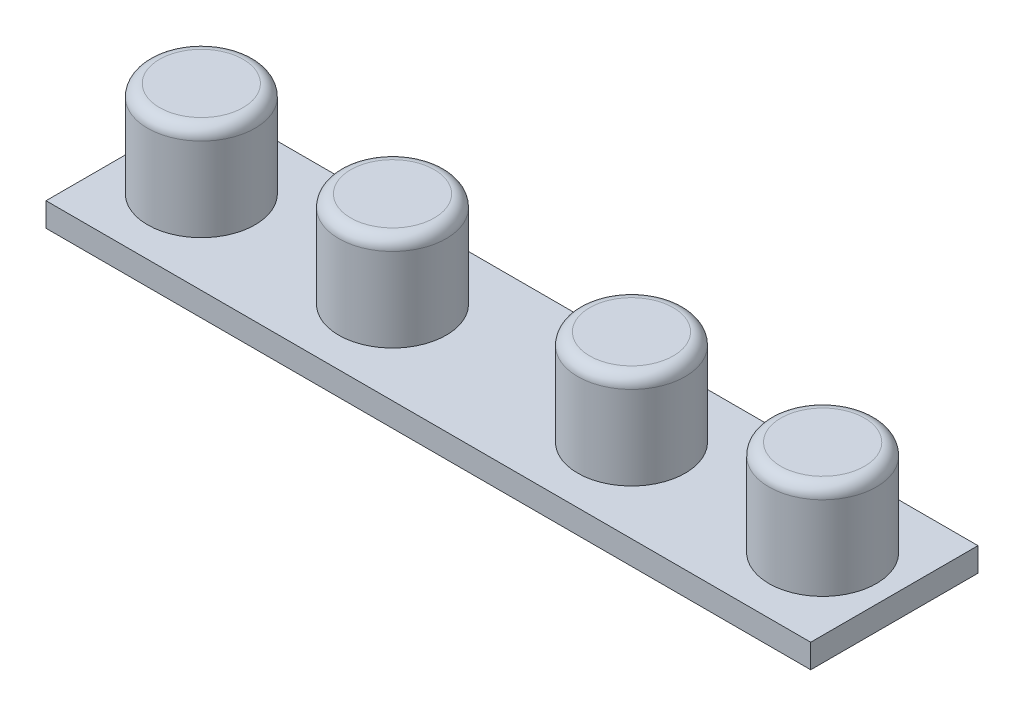
ISO-10303-21;
HEADER;
FILE_DESCRIPTION(('STEP AP214'),'2;1');
FILE_NAME('part.step','',(''),(''),'','','');
FILE_SCHEMA(('AUTOMOTIVE_DESIGN { 1 0 10303 214 1 1 1 1 }'));
ENDSEC;
DATA;
#1=APPLICATION_CONTEXT('core data for automotive mechanical design processes');
#2=APPLICATION_PROTOCOL_DEFINITION('international standard','automotive_design',2000,#1);
#3=PRODUCT_CONTEXT('',#1,'mechanical');
#4=PRODUCT('Part','Part','',(#3));
#5=PRODUCT_RELATED_PRODUCT_CATEGORY('part','',(#4));
#6=PRODUCT_DEFINITION_FORMATION('','',#4);
#7=PRODUCT_DEFINITION_CONTEXT('part definition',#1,'design');
#8=PRODUCT_DEFINITION('design','',#6,#7);
#9=PRODUCT_DEFINITION_SHAPE('','',#8);
#10=(LENGTH_UNIT() NAMED_UNIT(*) SI_UNIT(.MILLI.,.METRE.));
#11=(NAMED_UNIT(*) PLANE_ANGLE_UNIT() SI_UNIT($,.RADIAN.));
#12=(NAMED_UNIT(*) SI_UNIT($,.STERADIAN.) SOLID_ANGLE_UNIT());
#13=UNCERTAINTY_MEASURE_WITH_UNIT(LENGTH_MEASURE(1.E-05),#10,'distance_accuracy_value','');
#14=(GEOMETRIC_REPRESENTATION_CONTEXT(3) GLOBAL_UNCERTAINTY_ASSIGNED_CONTEXT((#13)) GLOBAL_UNIT_ASSIGNED_CONTEXT((#10,
#11,#12)) REPRESENTATION_CONTEXT('',''));
#15=CARTESIAN_POINT('',(0.,0.,0.));
#16=DIRECTION('',(0.,0.,1.));
#17=DIRECTION('',(1.,0.,0.));
#18=AXIS2_PLACEMENT_3D('',#15,#16,#17);
#19=CARTESIAN_POINT('',(16.,1.,-3.5));
#20=DIRECTION('',(-1.,0.,0.));
#21=DIRECTION('',(0.,0.,1.));
#22=AXIS2_PLACEMENT_3D('',#19,#20,#21);
#23=PLANE('',#22);
#24=DIRECTION('',(0.,0.,-1.));
#25=VECTOR('',#24,1.);
#26=CARTESIAN_POINT('',(16.,0.,-3.5));
#27=LINE('',#26,#25);
#28=CARTESIAN_POINT('',(16.,0.,3.5));
#29=VERTEX_POINT('',#28);
#30=CARTESIAN_POINT('',(16.,0.,-3.5));
#31=VERTEX_POINT('',#30);
#32=EDGE_CURVE('E100',#29,#31,#27,.T.);
#33=ORIENTED_EDGE('',*,*,#32,.T.);
#34=DIRECTION('',(0.,-1.,0.));
#35=VECTOR('',#34,1.);
#36=CARTESIAN_POINT('',(16.,1.,-3.5));
#37=LINE('',#36,#35);
#38=CARTESIAN_POINT('',(16.,1.,-3.5));
#39=VERTEX_POINT('',#38);
#40=EDGE_CURVE('E91',#39,#31,#37,.T.);
#41=ORIENTED_EDGE('',*,*,#40,.F.);
#42=DIRECTION('',(0.,0.,-1.));
#43=VECTOR('',#42,1.);
#44=CARTESIAN_POINT('',(16.,1.,-3.5));
#45=LINE('',#44,#43);
#46=CARTESIAN_POINT('',(16.,1.,3.5));
#47=VERTEX_POINT('',#46);
#48=EDGE_CURVE('E85',#47,#39,#45,.T.);
#49=ORIENTED_EDGE('',*,*,#48,.F.);
#50=DIRECTION('',(0.,-1.,0.));
#51=VECTOR('',#50,1.);
#52=CARTESIAN_POINT('',(16.,1.,3.5));
#53=LINE('',#52,#51);
#54=EDGE_CURVE('E96',#47,#29,#53,.T.);
#55=ORIENTED_EDGE('',*,*,#54,.T.);
#56=EDGE_LOOP('',(#33,#41,#49,#55));
#57=FACE_BOUND('',#56,.T.);
#58=ADVANCED_FACE('F32',(#57),#23,.F.);
#59=CARTESIAN_POINT('',(-16.,1.,-3.5));
#60=DIRECTION('',(0.,0.,1.));
#61=DIRECTION('',(1.,0.,0.));
#62=AXIS2_PLACEMENT_3D('',#59,#60,#61);
#63=PLANE('',#62);
#64=DIRECTION('',(-1.,0.,0.));
#65=VECTOR('',#64,1.);
#66=CARTESIAN_POINT('',(-16.,0.,-3.5));
#67=LINE('',#66,#65);
#68=CARTESIAN_POINT('',(-16.,0.,-3.5));
#69=VERTEX_POINT('',#68);
#70=EDGE_CURVE('E90',#31,#69,#67,.T.);
#71=ORIENTED_EDGE('',*,*,#70,.T.);
#72=DIRECTION('',(0.,-1.,0.));
#73=VECTOR('',#72,1.);
#74=CARTESIAN_POINT('',(-16.,1.,-3.5));
#75=LINE('',#74,#73);
#76=CARTESIAN_POINT('',(-16.,1.,-3.5));
#77=VERTEX_POINT('',#76);
#78=EDGE_CURVE('E88',#77,#69,#75,.T.);
#79=ORIENTED_EDGE('',*,*,#78,.F.);
#80=DIRECTION('',(-1.,0.,0.));
#81=VECTOR('',#80,1.);
#82=CARTESIAN_POINT('',(-16.,1.,-3.5));
#83=LINE('',#82,#81);
#84=EDGE_CURVE('E80',#39,#77,#83,.T.);
#85=ORIENTED_EDGE('',*,*,#84,.F.);
#86=ORIENTED_EDGE('',*,*,#40,.T.);
#87=EDGE_LOOP('',(#71,#79,#85,#86));
#88=FACE_BOUND('',#87,.T.);
#89=ADVANCED_FACE('F89',(#88),#63,.F.);
#90=CARTESIAN_POINT('',(-16.,1.,-3.5));
#91=DIRECTION('',(1.,0.,0.));
#92=DIRECTION('',(0.,0.,-1.));
#93=AXIS2_PLACEMENT_3D('',#90,#91,#92);
#94=PLANE('',#93);
#95=DIRECTION('',(0.,0.,1.));
#96=VECTOR('',#95,1.);
#97=CARTESIAN_POINT('',(-16.,0.,-3.5));
#98=LINE('',#97,#96);
#99=CARTESIAN_POINT('',(-16.,0.,3.5));
#100=VERTEX_POINT('',#99);
#101=EDGE_CURVE('E66',#69,#100,#98,.T.);
#102=ORIENTED_EDGE('',*,*,#101,.T.);
#103=DIRECTION('',(0.,-1.,0.));
#104=VECTOR('',#103,1.);
#105=CARTESIAN_POINT('',(-16.,1.,3.5));
#106=LINE('',#105,#104);
#107=CARTESIAN_POINT('',(-16.,1.,3.5));
#108=VERTEX_POINT('',#107);
#109=EDGE_CURVE('E92',#108,#100,#106,.T.);
#110=ORIENTED_EDGE('',*,*,#109,.F.);
#111=DIRECTION('',(0.,0.,1.));
#112=VECTOR('',#111,1.);
#113=CARTESIAN_POINT('',(-16.,1.,-3.5));
#114=LINE('',#113,#112);
#115=EDGE_CURVE('E83',#77,#108,#114,.T.);
#116=ORIENTED_EDGE('',*,*,#115,.F.);
#117=ORIENTED_EDGE('',*,*,#78,.T.);
#118=EDGE_LOOP('',(#102,#110,#116,#117));
#119=FACE_BOUND('',#118,.T.);
#120=ADVANCED_FACE('F94',(#119),#94,.F.);
#121=CARTESIAN_POINT('',(-16.,1.,3.5));
#122=DIRECTION('',(0.,0.,-1.));
#123=DIRECTION('',(-1.,0.,0.));
#124=AXIS2_PLACEMENT_3D('',#121,#122,#123);
#125=PLANE('',#124);
#126=DIRECTION('',(1.,0.,0.));
#127=VECTOR('',#126,1.);
#128=CARTESIAN_POINT('',(-16.,0.,3.5));
#129=LINE('',#128,#127);
#130=EDGE_CURVE('E72',#100,#29,#129,.T.);
#131=ORIENTED_EDGE('',*,*,#130,.T.);
#132=ORIENTED_EDGE('',*,*,#54,.F.);
#133=DIRECTION('',(1.,0.,0.));
#134=VECTOR('',#133,1.);
#135=CARTESIAN_POINT('',(-16.,1.,3.5));
#136=LINE('',#135,#134);
#137=EDGE_CURVE('E49',#108,#47,#136,.T.);
#138=ORIENTED_EDGE('',*,*,#137,.F.);
#139=ORIENTED_EDGE('',*,*,#109,.T.);
#140=EDGE_LOOP('',(#131,#132,#138,#139));
#141=FACE_BOUND('',#140,.T.);
#142=ADVANCED_FACE('F195',(#141),#125,.F.);
#143=CARTESIAN_POINT('',(0.,1.,0.));
#144=DIRECTION('',(0.,1.,0.));
#145=DIRECTION('',(0.,0.,1.));
#146=AXIS2_PLACEMENT_3D('',#143,#144,#145);
#147=PLANE('',#146);
#148=CARTESIAN_POINT('',(13.,1.,0.));
#149=DIRECTION('',(0.,1.,0.));
#150=DIRECTION('',(0.,0.,1.));
#151=AXIS2_PLACEMENT_3D('',#148,#149,#150);
#152=CIRCLE('',#151,2.25);
#153=CARTESIAN_POINT('',(13.,1.,2.25));
#154=VERTEX_POINT('',#153);
#155=EDGE_CURVE('E316',#154,#154,#152,.T.);
#156=ORIENTED_EDGE('',*,*,#155,.F.);
#157=EDGE_LOOP('',(#156));
#158=FACE_BOUND('',#157,.T.);
#159=CARTESIAN_POINT('',(5.,1.,0.));
#160=DIRECTION('',(0.,1.,0.));
#161=DIRECTION('',(0.,0.,1.));
#162=AXIS2_PLACEMENT_3D('',#159,#160,#161);
#163=CIRCLE('',#162,2.25);
#164=CARTESIAN_POINT('',(5.,1.,2.25));
#165=VERTEX_POINT('',#164);
#166=EDGE_CURVE('E313',#165,#165,#163,.T.);
#167=ORIENTED_EDGE('',*,*,#166,.F.);
#168=EDGE_LOOP('',(#167));
#169=FACE_BOUND('',#168,.T.);
#170=CARTESIAN_POINT('',(-5.,1.,0.));
#171=DIRECTION('',(0.,1.,0.));
#172=DIRECTION('',(0.,0.,1.));
#173=AXIS2_PLACEMENT_3D('',#170,#171,#172);
#174=CIRCLE('',#173,2.25);
#175=CARTESIAN_POINT('',(-5.,1.,2.25));
#176=VERTEX_POINT('',#175);
#177=EDGE_CURVE('E310',#176,#176,#174,.T.);
#178=ORIENTED_EDGE('',*,*,#177,.F.);
#179=EDGE_LOOP('',(#178));
#180=FACE_BOUND('',#179,.T.);
#181=CARTESIAN_POINT('',(-13.,1.,0.));
#182=DIRECTION('',(0.,1.,0.));
#183=DIRECTION('',(0.,0.,1.));
#184=AXIS2_PLACEMENT_3D('',#181,#182,#183);
#185=CIRCLE('',#184,2.25);
#186=CARTESIAN_POINT('',(-13.,1.,2.25));
#187=VERTEX_POINT('',#186);
#188=EDGE_CURVE('E103',#187,#187,#185,.T.);
#189=ORIENTED_EDGE('',*,*,#188,.F.);
#190=EDGE_LOOP('',(#189));
#191=FACE_BOUND('',#190,.T.);
#192=ORIENTED_EDGE('',*,*,#48,.T.);
#193=ORIENTED_EDGE('',*,*,#84,.T.);
#194=ORIENTED_EDGE('',*,*,#115,.T.);
#195=ORIENTED_EDGE('',*,*,#137,.T.);
#196=EDGE_LOOP('',(#192,#193,#194,#195));
#197=FACE_BOUND('',#196,.T.);
#198=ADVANCED_FACE('F81',(#158,#169,#180,#191,#197),#147,.T.);
#199=CARTESIAN_POINT('',(0.,0.,0.));
#200=DIRECTION('',(0.,1.,0.));
#201=DIRECTION('',(0.,0.,1.));
#202=AXIS2_PLACEMENT_3D('',#199,#200,#201);
#203=PLANE('',#202);
#204=ORIENTED_EDGE('',*,*,#32,.F.);
#205=ORIENTED_EDGE('',*,*,#130,.F.);
#206=ORIENTED_EDGE('',*,*,#101,.F.);
#207=ORIENTED_EDGE('',*,*,#70,.F.);
#208=EDGE_LOOP('',(#204,#205,#206,#207));
#209=FACE_BOUND('',#208,.T.);
#210=ADVANCED_FACE('F191',(#209),#203,.F.);
#211=CARTESIAN_POINT('',(-13.,5.,0.));
#212=DIRECTION('',(0.,-1.,0.));
#213=DIRECTION('',(0.,0.,-1.));
#214=AXIS2_PLACEMENT_3D('',#211,#212,#213);
#215=CYLINDRICAL_SURFACE('',#214,2.25);
#216=CARTESIAN_POINT('',(-13.,4.5,0.));
#217=DIRECTION('',(0.,1.,0.));
#218=DIRECTION('',(0.,0.,1.));
#219=AXIS2_PLACEMENT_3D('',#216,#217,#218);
#220=CIRCLE('',#219,2.25);
#221=CARTESIAN_POINT('',(-13.,4.5,2.25));
#222=VERTEX_POINT('',#221);
#223=EDGE_CURVE('E11',#222,#222,#220,.F.);
#224=ORIENTED_EDGE('',*,*,#223,.T.);
#225=EDGE_LOOP('',(#224));
#226=FACE_BOUND('',#225,.T.);
#227=ORIENTED_EDGE('',*,*,#188,.T.);
#228=EDGE_LOOP('',(#227));
#229=FACE_BOUND('',#228,.T.);
#230=ADVANCED_FACE('F188',(#226,#229),#215,.T.);
#231=CARTESIAN_POINT('',(-13.,5.,0.));
#232=DIRECTION('',(0.,1.,0.));
#233=DIRECTION('',(0.,0.,1.));
#234=AXIS2_PLACEMENT_3D('',#231,#232,#233);
#235=PLANE('',#234);
#236=CARTESIAN_POINT('',(-13.,5.,0.));
#237=DIRECTION('',(0.,1.,0.));
#238=DIRECTION('',(0.,0.,1.));
#239=AXIS2_PLACEMENT_3D('',#236,#237,#238);
#240=CIRCLE('',#239,1.75);
#241=CARTESIAN_POINT('',(-13.,5.,1.75));
#242=VERTEX_POINT('',#241);
#243=EDGE_CURVE('E41',#242,#242,#240,.T.);
#244=ORIENTED_EDGE('',*,*,#243,.T.);
#245=EDGE_LOOP('',(#244));
#246=FACE_BOUND('',#245,.T.);
#247=ADVANCED_FACE('F130',(#246),#235,.T.);
#248=CARTESIAN_POINT('',(-5.,5.,0.));
#249=DIRECTION('',(0.,-1.,0.));
#250=DIRECTION('',(0.,0.,-1.));
#251=AXIS2_PLACEMENT_3D('',#248,#249,#250);
#252=CYLINDRICAL_SURFACE('',#251,2.25);
#253=CARTESIAN_POINT('',(-5.,4.5,0.));
#254=DIRECTION('',(0.,1.,0.));
#255=DIRECTION('',(0.,0.,1.));
#256=AXIS2_PLACEMENT_3D('',#253,#254,#255);
#257=CIRCLE('',#256,2.25);
#258=CARTESIAN_POINT('',(-5.,4.5,2.25));
#259=VERTEX_POINT('',#258);
#260=EDGE_CURVE('E125',#259,#259,#257,.F.);
#261=ORIENTED_EDGE('',*,*,#260,.T.);
#262=EDGE_LOOP('',(#261));
#263=FACE_BOUND('',#262,.T.);
#264=ORIENTED_EDGE('',*,*,#177,.T.);
#265=EDGE_LOOP('',(#264));
#266=FACE_BOUND('',#265,.T.);
#267=ADVANCED_FACE('F181',(#263,#266),#252,.T.);
#268=CARTESIAN_POINT('',(-5.,5.,0.));
#269=DIRECTION('',(0.,1.,0.));
#270=DIRECTION('',(0.,0.,1.));
#271=AXIS2_PLACEMENT_3D('',#268,#269,#270);
#272=PLANE('',#271);
#273=CARTESIAN_POINT('',(-5.,5.,0.));
#274=DIRECTION('',(0.,1.,0.));
#275=DIRECTION('',(0.,0.,1.));
#276=AXIS2_PLACEMENT_3D('',#273,#274,#275);
#277=CIRCLE('',#276,1.75);
#278=CARTESIAN_POINT('',(-5.,5.,1.75));
#279=VERTEX_POINT('',#278);
#280=EDGE_CURVE('E122',#279,#279,#277,.T.);
#281=ORIENTED_EDGE('',*,*,#280,.T.);
#282=EDGE_LOOP('',(#281));
#283=FACE_BOUND('',#282,.T.);
#284=ADVANCED_FACE('F174',(#283),#272,.T.);
#285=CARTESIAN_POINT('',(5.,5.,0.));
#286=DIRECTION('',(0.,-1.,0.));
#287=DIRECTION('',(0.,0.,-1.));
#288=AXIS2_PLACEMENT_3D('',#285,#286,#287);
#289=CYLINDRICAL_SURFACE('',#288,2.25);
#290=CARTESIAN_POINT('',(5.,4.5,0.));
#291=DIRECTION('',(0.,1.,0.));
#292=DIRECTION('',(0.,0.,1.));
#293=AXIS2_PLACEMENT_3D('',#290,#291,#292);
#294=CIRCLE('',#293,2.25);
#295=CARTESIAN_POINT('',(5.,4.5,2.25));
#296=VERTEX_POINT('',#295);
#297=EDGE_CURVE('E119',#296,#296,#294,.F.);
#298=ORIENTED_EDGE('',*,*,#297,.T.);
#299=EDGE_LOOP('',(#298));
#300=FACE_BOUND('',#299,.T.);
#301=ORIENTED_EDGE('',*,*,#166,.T.);
#302=EDGE_LOOP('',(#301));
#303=FACE_BOUND('',#302,.T.);
#304=ADVANCED_FACE('F166',(#300,#303),#289,.T.);
#305=CARTESIAN_POINT('',(5.,5.,0.));
#306=DIRECTION('',(0.,1.,0.));
#307=DIRECTION('',(0.,0.,1.));
#308=AXIS2_PLACEMENT_3D('',#305,#306,#307);
#309=PLANE('',#308);
#310=CARTESIAN_POINT('',(5.,5.,0.));
#311=DIRECTION('',(0.,1.,0.));
#312=DIRECTION('',(0.,0.,1.));
#313=AXIS2_PLACEMENT_3D('',#310,#311,#312);
#314=CIRCLE('',#313,1.75);
#315=CARTESIAN_POINT('',(5.,5.,1.75));
#316=VERTEX_POINT('',#315);
#317=EDGE_CURVE('E116',#316,#316,#314,.T.);
#318=ORIENTED_EDGE('',*,*,#317,.T.);
#319=EDGE_LOOP('',(#318));
#320=FACE_BOUND('',#319,.T.);
#321=ADVANCED_FACE('F163',(#320),#309,.T.);
#322=CARTESIAN_POINT('',(13.,5.,0.));
#323=DIRECTION('',(0.,-1.,0.));
#324=DIRECTION('',(0.,0.,-1.));
#325=AXIS2_PLACEMENT_3D('',#322,#323,#324);
#326=CYLINDRICAL_SURFACE('',#325,2.25);
#327=CARTESIAN_POINT('',(13.,4.5,0.));
#328=DIRECTION('',(0.,1.,0.));
#329=DIRECTION('',(0.,0.,1.));
#330=AXIS2_PLACEMENT_3D('',#327,#328,#329);
#331=CIRCLE('',#330,2.25);
#332=CARTESIAN_POINT('',(13.,4.5,2.25));
#333=VERTEX_POINT('',#332);
#334=EDGE_CURVE('E113',#333,#333,#331,.F.);
#335=ORIENTED_EDGE('',*,*,#334,.T.);
#336=EDGE_LOOP('',(#335));
#337=FACE_BOUND('',#336,.T.);
#338=ORIENTED_EDGE('',*,*,#155,.T.);
#339=EDGE_LOOP('',(#338));
#340=FACE_BOUND('',#339,.T.);
#341=ADVANCED_FACE('F165',(#337,#340),#326,.T.);
#342=CARTESIAN_POINT('',(13.,5.,0.));
#343=DIRECTION('',(0.,1.,0.));
#344=DIRECTION('',(0.,0.,1.));
#345=AXIS2_PLACEMENT_3D('',#342,#343,#344);
#346=PLANE('',#345);
#347=CARTESIAN_POINT('',(13.,5.,0.));
#348=DIRECTION('',(0.,1.,0.));
#349=DIRECTION('',(0.,0.,1.));
#350=AXIS2_PLACEMENT_3D('',#347,#348,#349);
#351=CIRCLE('',#350,1.75);
#352=CARTESIAN_POINT('',(13.,5.,1.75));
#353=VERTEX_POINT('',#352);
#354=EDGE_CURVE('E110',#353,#353,#351,.T.);
#355=ORIENTED_EDGE('',*,*,#354,.T.);
#356=EDGE_LOOP('',(#355));
#357=FACE_BOUND('',#356,.T.);
#358=ADVANCED_FACE('F153',(#357),#346,.T.);
#359=CARTESIAN_POINT('',(13.,4.5,0.));
#360=DIRECTION('',(0.,1.,0.));
#361=DIRECTION('',(0.,0.,1.));
#362=AXIS2_PLACEMENT_3D('',#359,#360,#361);
#363=TOROIDAL_SURFACE('',#362,1.75,0.5);
#364=ORIENTED_EDGE('',*,*,#334,.F.);
#365=EDGE_LOOP('',(#364));
#366=FACE_BOUND('',#365,.T.);
#367=ORIENTED_EDGE('',*,*,#354,.F.);
#368=EDGE_LOOP('',(#367));
#369=FACE_BOUND('',#368,.T.);
#370=ADVANCED_FACE('F150',(#366,#369),#363,.T.);
#371=CARTESIAN_POINT('',(5.,4.5,0.));
#372=DIRECTION('',(0.,1.,0.));
#373=DIRECTION('',(0.,0.,1.));
#374=AXIS2_PLACEMENT_3D('',#371,#372,#373);
#375=TOROIDAL_SURFACE('',#374,1.75,0.5);
#376=ORIENTED_EDGE('',*,*,#297,.F.);
#377=EDGE_LOOP('',(#376));
#378=FACE_BOUND('',#377,.T.);
#379=ORIENTED_EDGE('',*,*,#317,.F.);
#380=EDGE_LOOP('',(#379));
#381=FACE_BOUND('',#380,.T.);
#382=ADVANCED_FACE('F138',(#378,#381),#375,.T.);
#383=CARTESIAN_POINT('',(-5.,4.5,0.));
#384=DIRECTION('',(0.,1.,0.));
#385=DIRECTION('',(0.,0.,1.));
#386=AXIS2_PLACEMENT_3D('',#383,#384,#385);
#387=TOROIDAL_SURFACE('',#386,1.75,0.5);
#388=ORIENTED_EDGE('',*,*,#260,.F.);
#389=EDGE_LOOP('',(#388));
#390=FACE_BOUND('',#389,.T.);
#391=ORIENTED_EDGE('',*,*,#280,.F.);
#392=EDGE_LOOP('',(#391));
#393=FACE_BOUND('',#392,.T.);
#394=ADVANCED_FACE('F133',(#390,#393),#387,.T.);
#395=CARTESIAN_POINT('',(-13.,4.5,0.));
#396=DIRECTION('',(0.,1.,0.));
#397=DIRECTION('',(0.,0.,1.));
#398=AXIS2_PLACEMENT_3D('',#395,#396,#397);
#399=TOROIDAL_SURFACE('',#398,1.75,0.5);
#400=ORIENTED_EDGE('',*,*,#223,.F.);
#401=EDGE_LOOP('',(#400));
#402=FACE_BOUND('',#401,.T.);
#403=ORIENTED_EDGE('',*,*,#243,.F.);
#404=EDGE_LOOP('',(#403));
#405=FACE_BOUND('',#404,.T.);
#406=ADVANCED_FACE('F34',(#402,#405),#399,.T.);
#407=CLOSED_SHELL('',(#58,#89,#120,#142,#198,#210,#230,#247,#267,#284,#304,#321,#341,#358,#370,
#382,#394,#406));
#408=MANIFOLD_SOLID_BREP('B2',#407);
#409=ADVANCED_BREP_SHAPE_REPRESENTATION('',(#18,#408),#14);
#410=SHAPE_DEFINITION_REPRESENTATION(#9,#409);
ENDSEC;
END-ISO-10303-21;
